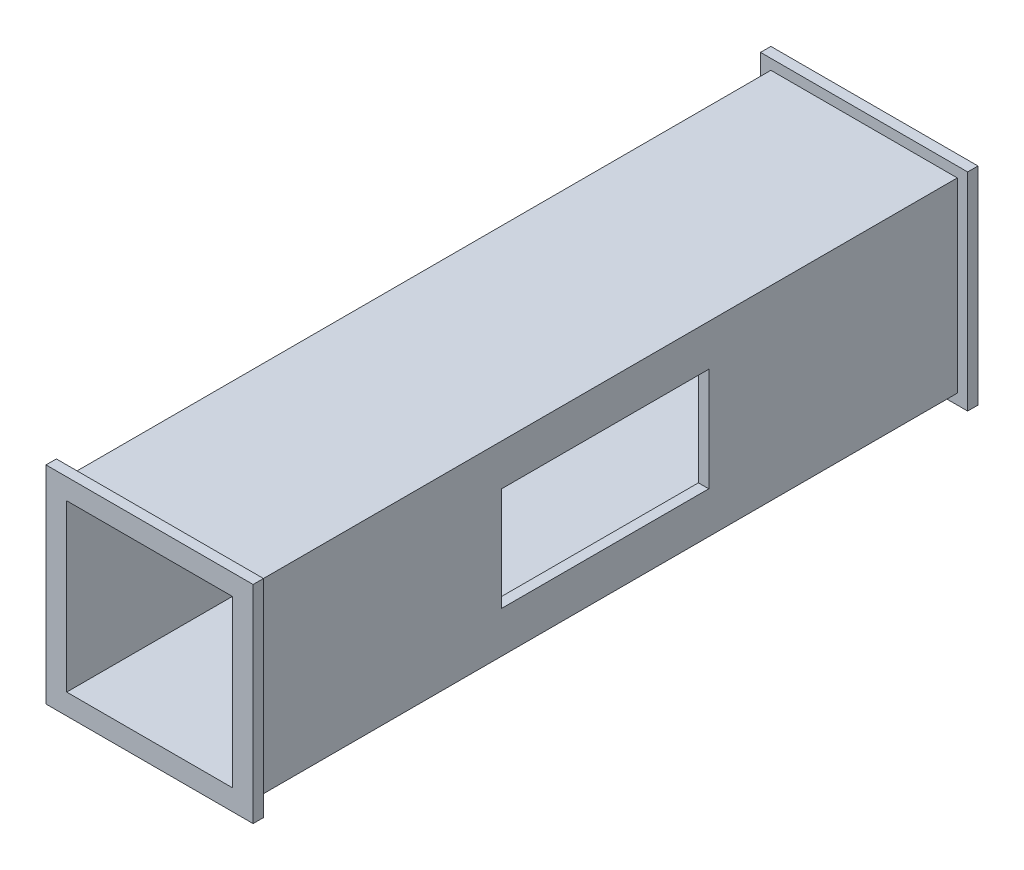
ISO-10303-21;
HEADER;
FILE_DESCRIPTION(('STEP AP214'),'2;1');
FILE_NAME('part.step','',(''),(''),'','','');
FILE_SCHEMA(('AUTOMOTIVE_DESIGN { 1 0 10303 214 1 1 1 1 }'));
ENDSEC;
DATA;
#1=APPLICATION_CONTEXT('core data for automotive mechanical design processes');
#2=APPLICATION_PROTOCOL_DEFINITION('international standard','automotive_design',2000,#1);
#3=PRODUCT_CONTEXT('',#1,'mechanical');
#4=PRODUCT('Part','Part','',(#3));
#5=PRODUCT_RELATED_PRODUCT_CATEGORY('part','',(#4));
#6=PRODUCT_DEFINITION_FORMATION('','',#4);
#7=PRODUCT_DEFINITION_CONTEXT('part definition',#1,'design');
#8=PRODUCT_DEFINITION('design','',#6,#7);
#9=PRODUCT_DEFINITION_SHAPE('','',#8);
#10=(LENGTH_UNIT() NAMED_UNIT(*) SI_UNIT(.MILLI.,.METRE.));
#11=(NAMED_UNIT(*) PLANE_ANGLE_UNIT() SI_UNIT($,.RADIAN.));
#12=(NAMED_UNIT(*) SI_UNIT($,.STERADIAN.) SOLID_ANGLE_UNIT());
#13=UNCERTAINTY_MEASURE_WITH_UNIT(LENGTH_MEASURE(1.E-05),#10,'distance_accuracy_value','');
#14=(GEOMETRIC_REPRESENTATION_CONTEXT(3) GLOBAL_UNCERTAINTY_ASSIGNED_CONTEXT((#13)) GLOBAL_UNIT_ASSIGNED_CONTEXT((#10,
#11,#12)) REPRESENTATION_CONTEXT('',''));
#15=CARTESIAN_POINT('',(0.,0.,0.));
#16=DIRECTION('',(0.,0.,1.));
#17=DIRECTION('',(1.,0.,0.));
#18=AXIS2_PLACEMENT_3D('',#15,#16,#17);
#19=CARTESIAN_POINT('',(45.,-45.,350.));
#20=DIRECTION('',(-1.,0.,0.));
#21=DIRECTION('',(0.,0.,1.));
#22=AXIS2_PLACEMENT_3D('',#19,#20,#21);
#23=PLANE('',#22);
#24=DIRECTION('',(0.,0.,1.));
#25=VECTOR('',#24,1.);
#26=CARTESIAN_POINT('',(45.,25.,225.));
#27=LINE('',#26,#25);
#28=CARTESIAN_POINT('',(45.,25.,125.));
#29=VERTEX_POINT('',#28);
#30=CARTESIAN_POINT('',(45.,25.,225.));
#31=VERTEX_POINT('',#30);
#32=EDGE_CURVE('E308',#29,#31,#27,.T.);
#33=ORIENTED_EDGE('',*,*,#32,.F.);
#34=DIRECTION('',(0.,1.,0.));
#35=VECTOR('',#34,1.);
#36=CARTESIAN_POINT('',(45.,25.,125.));
#37=LINE('',#36,#35);
#38=CARTESIAN_POINT('',(45.,-25.,125.));
#39=VERTEX_POINT('',#38);
#40=EDGE_CURVE('E297',#39,#29,#37,.T.);
#41=ORIENTED_EDGE('',*,*,#40,.F.);
#42=DIRECTION('',(0.,0.,-1.));
#43=VECTOR('',#42,1.);
#44=CARTESIAN_POINT('',(45.,-25.,225.));
#45=LINE('',#44,#43);
#46=CARTESIAN_POINT('',(45.,-25.,225.));
#47=VERTEX_POINT('',#46);
#48=EDGE_CURVE('E316',#47,#39,#45,.T.);
#49=ORIENTED_EDGE('',*,*,#48,.F.);
#50=DIRECTION('',(0.,-1.,0.));
#51=VECTOR('',#50,1.);
#52=CARTESIAN_POINT('',(45.,25.,225.));
#53=LINE('',#52,#51);
#54=EDGE_CURVE('E312',#31,#47,#53,.T.);
#55=ORIENTED_EDGE('',*,*,#54,.F.);
#56=EDGE_LOOP('',(#33,#41,#49,#55));
#57=FACE_BOUND('',#56,.T.);
#58=DIRECTION('',(0.,-1.,0.));
#59=VECTOR('',#58,1.);
#60=CARTESIAN_POINT('',(45.,45.,5.));
#61=LINE('',#60,#59);
#62=CARTESIAN_POINT('',(45.,45.,5.));
#63=VERTEX_POINT('',#62);
#64=CARTESIAN_POINT('',(45.,-45.,5.));
#65=VERTEX_POINT('',#64);
#66=EDGE_CURVE('E54',#63,#65,#61,.T.);
#67=ORIENTED_EDGE('',*,*,#66,.F.);
#68=DIRECTION('',(0.,0.,-1.));
#69=VECTOR('',#68,1.);
#70=CARTESIAN_POINT('',(45.,45.,350.));
#71=LINE('',#70,#69);
#72=CARTESIAN_POINT('',(45.,45.,345.));
#73=VERTEX_POINT('',#72);
#74=EDGE_CURVE('E380',#73,#63,#71,.T.);
#75=ORIENTED_EDGE('',*,*,#74,.F.);
#76=DIRECTION('',(0.,1.,0.));
#77=VECTOR('',#76,1.);
#78=CARTESIAN_POINT('',(45.,-45.,345.));
#79=LINE('',#78,#77);
#80=CARTESIAN_POINT('',(45.,-45.,345.));
#81=VERTEX_POINT('',#80);
#82=EDGE_CURVE('E250',#81,#73,#79,.T.);
#83=ORIENTED_EDGE('',*,*,#82,.F.);
#84=DIRECTION('',(0.,0.,-1.));
#85=VECTOR('',#84,1.);
#86=CARTESIAN_POINT('',(45.,-45.,350.));
#87=LINE('',#86,#85);
#88=EDGE_CURVE('E188',#81,#65,#87,.T.);
#89=ORIENTED_EDGE('',*,*,#88,.T.);
#90=EDGE_LOOP('',(#67,#75,#83,#89));
#91=FACE_BOUND('',#90,.T.);
#92=ADVANCED_FACE('F39',(#57,#91),#23,.F.);
#93=CARTESIAN_POINT('',(-45.,45.,350.));
#94=DIRECTION('',(0.,-1.,0.));
#95=DIRECTION('',(0.,0.,-1.));
#96=AXIS2_PLACEMENT_3D('',#93,#94,#95);
#97=PLANE('',#96);
#98=DIRECTION('',(1.,0.,0.));
#99=VECTOR('',#98,1.);
#100=CARTESIAN_POINT('',(-45.,45.,5.));
#101=LINE('',#100,#99);
#102=CARTESIAN_POINT('',(-45.,45.,5.));
#103=VERTEX_POINT('',#102);
#104=EDGE_CURVE('E61',#103,#63,#101,.T.);
#105=ORIENTED_EDGE('',*,*,#104,.F.);
#106=DIRECTION('',(0.,0.,-1.));
#107=VECTOR('',#106,1.);
#108=CARTESIAN_POINT('',(-45.,45.,350.));
#109=LINE('',#108,#107);
#110=CARTESIAN_POINT('',(-45.,45.,345.));
#111=VERTEX_POINT('',#110);
#112=EDGE_CURVE('E187',#111,#103,#109,.T.);
#113=ORIENTED_EDGE('',*,*,#112,.F.);
#114=DIRECTION('',(-1.,0.,0.));
#115=VECTOR('',#114,1.);
#116=CARTESIAN_POINT('',(45.,45.,345.));
#117=LINE('',#116,#115);
#118=EDGE_CURVE('E254',#73,#111,#117,.T.);
#119=ORIENTED_EDGE('',*,*,#118,.F.);
#120=ORIENTED_EDGE('',*,*,#74,.T.);
#121=EDGE_LOOP('',(#105,#113,#119,#120));
#122=FACE_BOUND('',#121,.T.);
#123=ADVANCED_FACE('F414',(#122),#97,.F.);
#124=CARTESIAN_POINT('',(-45.,-45.,350.));
#125=DIRECTION('',(1.,0.,0.));
#126=DIRECTION('',(0.,0.,-1.));
#127=AXIS2_PLACEMENT_3D('',#124,#125,#126);
#128=PLANE('',#127);
#129=DIRECTION('',(0.,1.,0.));
#130=VECTOR('',#129,1.);
#131=CARTESIAN_POINT('',(-45.,-45.,5.));
#132=LINE('',#131,#130);
#133=CARTESIAN_POINT('',(-45.,-45.,5.));
#134=VERTEX_POINT('',#133);
#135=EDGE_CURVE('E191',#134,#103,#132,.T.);
#136=ORIENTED_EDGE('',*,*,#135,.F.);
#137=DIRECTION('',(0.,0.,-1.));
#138=VECTOR('',#137,1.);
#139=CARTESIAN_POINT('',(-45.,-45.,350.));
#140=LINE('',#139,#138);
#141=CARTESIAN_POINT('',(-45.,-45.,345.));
#142=VERTEX_POINT('',#141);
#143=EDGE_CURVE('E177',#142,#134,#140,.T.);
#144=ORIENTED_EDGE('',*,*,#143,.F.);
#145=DIRECTION('',(0.,-1.,0.));
#146=VECTOR('',#145,1.);
#147=CARTESIAN_POINT('',(-45.,45.,345.));
#148=LINE('',#147,#146);
#149=EDGE_CURVE('E258',#111,#142,#148,.T.);
#150=ORIENTED_EDGE('',*,*,#149,.F.);
#151=ORIENTED_EDGE('',*,*,#112,.T.);
#152=EDGE_LOOP('',(#136,#144,#150,#151));
#153=FACE_BOUND('',#152,.T.);
#154=ADVANCED_FACE('F192',(#153),#128,.F.);
#155=CARTESIAN_POINT('',(-45.,-45.,350.));
#156=DIRECTION('',(0.,1.,0.));
#157=DIRECTION('',(0.,0.,1.));
#158=AXIS2_PLACEMENT_3D('',#155,#156,#157);
#159=PLANE('',#158);
#160=DIRECTION('',(-1.,0.,0.));
#161=VECTOR('',#160,1.);
#162=CARTESIAN_POINT('',(45.,-45.,5.));
#163=LINE('',#162,#161);
#164=EDGE_CURVE('E181',#65,#134,#163,.T.);
#165=ORIENTED_EDGE('',*,*,#164,.F.);
#166=ORIENTED_EDGE('',*,*,#88,.F.);
#167=DIRECTION('',(1.,0.,0.));
#168=VECTOR('',#167,1.);
#169=CARTESIAN_POINT('',(-45.,-45.,345.));
#170=LINE('',#169,#168);
#171=EDGE_CURVE('E183',#142,#81,#170,.T.);
#172=ORIENTED_EDGE('',*,*,#171,.F.);
#173=ORIENTED_EDGE('',*,*,#143,.T.);
#174=EDGE_LOOP('',(#165,#166,#172,#173));
#175=FACE_BOUND('',#174,.T.);
#176=ADVANCED_FACE('F179',(#175),#159,.F.);
#177=CARTESIAN_POINT('',(0.,0.,350.));
#178=DIRECTION('',(0.,0.,-1.));
#179=DIRECTION('',(-1.,0.,0.));
#180=AXIS2_PLACEMENT_3D('',#177,#178,#179);
#181=PLANE('',#180);
#182=DIRECTION('',(0.,1.,0.));
#183=VECTOR('',#182,1.);
#184=CARTESIAN_POINT('',(40.,0.,350.));
#185=LINE('',#184,#183);
#186=CARTESIAN_POINT('',(40.,-40.,350.));
#187=VERTEX_POINT('',#186);
#188=CARTESIAN_POINT('',(40.,40.,350.));
#189=VERTEX_POINT('',#188);
#190=EDGE_CURVE('E357',#187,#189,#185,.T.);
#191=ORIENTED_EDGE('',*,*,#190,.F.);
#192=DIRECTION('',(1.,0.,0.));
#193=VECTOR('',#192,1.);
#194=CARTESIAN_POINT('',(0.,-40.,350.));
#195=LINE('',#194,#193);
#196=CARTESIAN_POINT('',(-40.,-40.,350.));
#197=VERTEX_POINT('',#196);
#198=EDGE_CURVE('E343',#197,#187,#195,.T.);
#199=ORIENTED_EDGE('',*,*,#198,.F.);
#200=DIRECTION('',(0.,-1.,0.));
#201=VECTOR('',#200,1.);
#202=CARTESIAN_POINT('',(-40.,0.,350.));
#203=LINE('',#202,#201);
#204=CARTESIAN_POINT('',(-40.,40.,350.));
#205=VERTEX_POINT('',#204);
#206=EDGE_CURVE('E370',#205,#197,#203,.T.);
#207=ORIENTED_EDGE('',*,*,#206,.F.);
#208=DIRECTION('',(-1.,0.,0.));
#209=VECTOR('',#208,1.);
#210=CARTESIAN_POINT('',(0.,40.,350.));
#211=LINE('',#210,#209);
#212=EDGE_CURVE('E367',#189,#205,#211,.T.);
#213=ORIENTED_EDGE('',*,*,#212,.F.);
#214=EDGE_LOOP('',(#191,#199,#207,#213));
#215=FACE_BOUND('',#214,.T.);
#216=DIRECTION('',(1.,0.,0.));
#217=VECTOR('',#216,1.);
#218=CARTESIAN_POINT('',(-50.,-50.,350.));
#219=LINE('',#218,#217);
#220=CARTESIAN_POINT('',(-50.,-50.,350.));
#221=VERTEX_POINT('',#220);
#222=CARTESIAN_POINT('',(50.,-50.,350.));
#223=VERTEX_POINT('',#222);
#224=EDGE_CURVE('E261',#221,#223,#219,.T.);
#225=ORIENTED_EDGE('',*,*,#224,.T.);
#226=DIRECTION('',(0.,1.,0.));
#227=VECTOR('',#226,1.);
#228=CARTESIAN_POINT('',(50.,-50.,350.));
#229=LINE('',#228,#227);
#230=CARTESIAN_POINT('',(50.,50.,350.));
#231=VERTEX_POINT('',#230);
#232=EDGE_CURVE('E283',#223,#231,#229,.T.);
#233=ORIENTED_EDGE('',*,*,#232,.T.);
#234=DIRECTION('',(-1.,0.,0.));
#235=VECTOR('',#234,1.);
#236=CARTESIAN_POINT('',(50.,50.,350.));
#237=LINE('',#236,#235);
#238=CARTESIAN_POINT('',(-50.,50.,350.));
#239=VERTEX_POINT('',#238);
#240=EDGE_CURVE('E287',#231,#239,#237,.T.);
#241=ORIENTED_EDGE('',*,*,#240,.T.);
#242=DIRECTION('',(0.,-1.,0.));
#243=VECTOR('',#242,1.);
#244=CARTESIAN_POINT('',(-50.,50.,350.));
#245=LINE('',#244,#243);
#246=EDGE_CURVE('E267',#239,#221,#245,.T.);
#247=ORIENTED_EDGE('',*,*,#246,.T.);
#248=EDGE_LOOP('',(#225,#233,#241,#247));
#249=FACE_BOUND('',#248,.T.);
#250=ADVANCED_FACE('F425',(#215,#249),#181,.F.);
#251=CARTESIAN_POINT('',(0.,0.,0.));
#252=DIRECTION('',(0.,0.,-1.));
#253=DIRECTION('',(-1.,0.,0.));
#254=AXIS2_PLACEMENT_3D('',#251,#252,#253);
#255=PLANE('',#254);
#256=DIRECTION('',(1.,0.,0.));
#257=VECTOR('',#256,1.);
#258=CARTESIAN_POINT('',(0.,-40.,0.));
#259=LINE('',#258,#257);
#260=CARTESIAN_POINT('',(-40.,-40.,0.));
#261=VERTEX_POINT('',#260);
#262=CARTESIAN_POINT('',(40.,-40.,0.));
#263=VERTEX_POINT('',#262);
#264=EDGE_CURVE('E353',#261,#263,#259,.T.);
#265=ORIENTED_EDGE('',*,*,#264,.T.);
#266=DIRECTION('',(0.,1.,0.));
#267=VECTOR('',#266,1.);
#268=CARTESIAN_POINT('',(40.,0.,0.));
#269=LINE('',#268,#267);
#270=CARTESIAN_POINT('',(40.,40.,0.));
#271=VERTEX_POINT('',#270);
#272=EDGE_CURVE('E324',#263,#271,#269,.T.);
#273=ORIENTED_EDGE('',*,*,#272,.T.);
#274=DIRECTION('',(-1.,0.,0.));
#275=VECTOR('',#274,1.);
#276=CARTESIAN_POINT('',(0.,40.,0.));
#277=LINE('',#276,#275);
#278=CARTESIAN_POINT('',(-40.,40.,0.));
#279=VERTEX_POINT('',#278);
#280=EDGE_CURVE('E352',#271,#279,#277,.T.);
#281=ORIENTED_EDGE('',*,*,#280,.T.);
#282=DIRECTION('',(0.,-1.,0.));
#283=VECTOR('',#282,1.);
#284=CARTESIAN_POINT('',(-40.,0.,0.));
#285=LINE('',#284,#283);
#286=EDGE_CURVE('E358',#279,#261,#285,.T.);
#287=ORIENTED_EDGE('',*,*,#286,.T.);
#288=EDGE_LOOP('',(#265,#273,#281,#287));
#289=FACE_BOUND('',#288,.T.);
#290=DIRECTION('',(1.,0.,0.));
#291=VECTOR('',#290,1.);
#292=CARTESIAN_POINT('',(-50.,50.,0.));
#293=LINE('',#292,#291);
#294=CARTESIAN_POINT('',(-50.,50.,0.));
#295=VERTEX_POINT('',#294);
#296=CARTESIAN_POINT('',(50.,50.,0.));
#297=VERTEX_POINT('',#296);
#298=EDGE_CURVE('E195',#295,#297,#293,.T.);
#299=ORIENTED_EDGE('',*,*,#298,.T.);
#300=DIRECTION('',(0.,-1.,0.));
#301=VECTOR('',#300,1.);
#302=CARTESIAN_POINT('',(50.,50.,0.));
#303=LINE('',#302,#301);
#304=CARTESIAN_POINT('',(50.,-50.,0.));
#305=VERTEX_POINT('',#304);
#306=EDGE_CURVE('E226',#297,#305,#303,.T.);
#307=ORIENTED_EDGE('',*,*,#306,.T.);
#308=DIRECTION('',(-1.,0.,0.));
#309=VECTOR('',#308,1.);
#310=CARTESIAN_POINT('',(50.,-50.,0.));
#311=LINE('',#310,#309);
#312=CARTESIAN_POINT('',(-50.,-50.,0.));
#313=VERTEX_POINT('',#312);
#314=EDGE_CURVE('E230',#305,#313,#311,.T.);
#315=ORIENTED_EDGE('',*,*,#314,.T.);
#316=DIRECTION('',(0.,1.,0.));
#317=VECTOR('',#316,1.);
#318=CARTESIAN_POINT('',(-50.,-50.,0.));
#319=LINE('',#318,#317);
#320=EDGE_CURVE('E210',#313,#295,#319,.T.);
#321=ORIENTED_EDGE('',*,*,#320,.T.);
#322=EDGE_LOOP('',(#299,#307,#315,#321));
#323=FACE_BOUND('',#322,.T.);
#324=ADVANCED_FACE('F426',(#289,#323),#255,.T.);
#325=CARTESIAN_POINT('',(40.,-45.,350.));
#326=DIRECTION('',(-1.,0.,0.));
#327=DIRECTION('',(0.,0.,1.));
#328=AXIS2_PLACEMENT_3D('',#325,#326,#327);
#329=PLANE('',#328);
#330=DIRECTION('',(0.,-1.,0.));
#331=VECTOR('',#330,1.);
#332=CARTESIAN_POINT('',(40.,-45.,125.));
#333=LINE('',#332,#331);
#334=CARTESIAN_POINT('',(40.,25.,125.));
#335=VERTEX_POINT('',#334);
#336=CARTESIAN_POINT('',(40.,-25.,125.));
#337=VERTEX_POINT('',#336);
#338=EDGE_CURVE('E11',#335,#337,#333,.T.);
#339=ORIENTED_EDGE('',*,*,#338,.F.);
#340=DIRECTION('',(0.,0.,-1.));
#341=VECTOR('',#340,1.);
#342=CARTESIAN_POINT('',(40.,25.,350.));
#343=LINE('',#342,#341);
#344=CARTESIAN_POINT('',(40.,25.,225.));
#345=VERTEX_POINT('',#344);
#346=EDGE_CURVE('E383',#345,#335,#343,.T.);
#347=ORIENTED_EDGE('',*,*,#346,.F.);
#348=DIRECTION('',(0.,1.,0.));
#349=VECTOR('',#348,1.);
#350=CARTESIAN_POINT('',(40.,-45.,225.));
#351=LINE('',#350,#349);
#352=CARTESIAN_POINT('',(40.,-25.,225.));
#353=VERTEX_POINT('',#352);
#354=EDGE_CURVE('E386',#353,#345,#351,.T.);
#355=ORIENTED_EDGE('',*,*,#354,.F.);
#356=DIRECTION('',(0.,0.,1.));
#357=VECTOR('',#356,1.);
#358=CARTESIAN_POINT('',(40.,-25.,350.));
#359=LINE('',#358,#357);
#360=EDGE_CURVE('E47',#337,#353,#359,.T.);
#361=ORIENTED_EDGE('',*,*,#360,.F.);
#362=EDGE_LOOP('',(#339,#347,#355,#361));
#363=FACE_BOUND('',#362,.T.);
#364=ORIENTED_EDGE('',*,*,#272,.F.);
#365=DIRECTION('',(0.,0.,-1.));
#366=VECTOR('',#365,1.);
#367=CARTESIAN_POINT('',(40.,-40.,350.));
#368=LINE('',#367,#366);
#369=EDGE_CURVE('E339',#187,#263,#368,.T.);
#370=ORIENTED_EDGE('',*,*,#369,.F.);
#371=ORIENTED_EDGE('',*,*,#190,.T.);
#372=DIRECTION('',(0.,0.,-1.));
#373=VECTOR('',#372,1.);
#374=CARTESIAN_POINT('',(40.,40.,350.));
#375=LINE('',#374,#373);
#376=EDGE_CURVE('E334',#189,#271,#375,.T.);
#377=ORIENTED_EDGE('',*,*,#376,.T.);
#378=EDGE_LOOP('',(#364,#370,#371,#377));
#379=FACE_BOUND('',#378,.T.);
#380=ADVANCED_FACE('F403',(#363,#379),#329,.T.);
#381=CARTESIAN_POINT('',(-45.,40.,350.));
#382=DIRECTION('',(0.,-1.,0.));
#383=DIRECTION('',(0.,0.,-1.));
#384=AXIS2_PLACEMENT_3D('',#381,#382,#383);
#385=PLANE('',#384);
#386=ORIENTED_EDGE('',*,*,#280,.F.);
#387=ORIENTED_EDGE('',*,*,#376,.F.);
#388=ORIENTED_EDGE('',*,*,#212,.T.);
#389=DIRECTION('',(0.,0.,-1.));
#390=VECTOR('',#389,1.);
#391=CARTESIAN_POINT('',(-40.,40.,350.));
#392=LINE('',#391,#390);
#393=EDGE_CURVE('E338',#205,#279,#392,.T.);
#394=ORIENTED_EDGE('',*,*,#393,.T.);
#395=EDGE_LOOP('',(#386,#387,#388,#394));
#396=FACE_BOUND('',#395,.T.);
#397=ADVANCED_FACE('F440',(#396),#385,.T.);
#398=CARTESIAN_POINT('',(-40.,-45.,350.));
#399=DIRECTION('',(1.,0.,0.));
#400=DIRECTION('',(0.,0.,-1.));
#401=AXIS2_PLACEMENT_3D('',#398,#399,#400);
#402=PLANE('',#401);
#403=ORIENTED_EDGE('',*,*,#286,.F.);
#404=ORIENTED_EDGE('',*,*,#393,.F.);
#405=ORIENTED_EDGE('',*,*,#206,.T.);
#406=DIRECTION('',(0.,0.,-1.));
#407=VECTOR('',#406,1.);
#408=CARTESIAN_POINT('',(-40.,-40.,350.));
#409=LINE('',#408,#407);
#410=EDGE_CURVE('E342',#197,#261,#409,.T.);
#411=ORIENTED_EDGE('',*,*,#410,.T.);
#412=EDGE_LOOP('',(#403,#404,#405,#411));
#413=FACE_BOUND('',#412,.T.);
#414=ADVANCED_FACE('F436',(#413),#402,.T.);
#415=CARTESIAN_POINT('',(-45.,-40.,350.));
#416=DIRECTION('',(0.,1.,0.));
#417=DIRECTION('',(0.,0.,1.));
#418=AXIS2_PLACEMENT_3D('',#415,#416,#417);
#419=PLANE('',#418);
#420=ORIENTED_EDGE('',*,*,#264,.F.);
#421=ORIENTED_EDGE('',*,*,#410,.F.);
#422=ORIENTED_EDGE('',*,*,#198,.T.);
#423=ORIENTED_EDGE('',*,*,#369,.T.);
#424=EDGE_LOOP('',(#420,#421,#422,#423));
#425=FACE_BOUND('',#424,.T.);
#426=ADVANCED_FACE('F433',(#425),#419,.T.);
#427=CARTESIAN_POINT('',(25.,25.,125.));
#428=DIRECTION('',(0.,0.,-1.));
#429=DIRECTION('',(-1.,0.,0.));
#430=AXIS2_PLACEMENT_3D('',#427,#428,#429);
#431=PLANE('',#430);
#432=ORIENTED_EDGE('',*,*,#338,.T.);
#433=DIRECTION('',(1.,0.,0.));
#434=VECTOR('',#433,1.);
#435=CARTESIAN_POINT('',(25.,-25.,125.));
#436=LINE('',#435,#434);
#437=EDGE_CURVE('E321',#337,#39,#436,.T.);
#438=ORIENTED_EDGE('',*,*,#437,.T.);
#439=ORIENTED_EDGE('',*,*,#40,.T.);
#440=DIRECTION('',(1.,0.,0.));
#441=VECTOR('',#440,1.);
#442=CARTESIAN_POINT('',(25.,25.,125.));
#443=LINE('',#442,#441);
#444=EDGE_CURVE('E320',#335,#29,#443,.T.);
#445=ORIENTED_EDGE('',*,*,#444,.F.);
#446=EDGE_LOOP('',(#432,#438,#439,#445));
#447=FACE_BOUND('',#446,.T.);
#448=ADVANCED_FACE('F410',(#447),#431,.F.);
#449=CARTESIAN_POINT('',(25.,-25.,225.));
#450=DIRECTION('',(0.,-1.,0.));
#451=DIRECTION('',(0.,0.,-1.));
#452=AXIS2_PLACEMENT_3D('',#449,#450,#451);
#453=PLANE('',#452);
#454=ORIENTED_EDGE('',*,*,#360,.T.);
#455=DIRECTION('',(1.,0.,0.));
#456=VECTOR('',#455,1.);
#457=CARTESIAN_POINT('',(25.,-25.,225.));
#458=LINE('',#457,#456);
#459=EDGE_CURVE('E325',#353,#47,#458,.T.);
#460=ORIENTED_EDGE('',*,*,#459,.T.);
#461=ORIENTED_EDGE('',*,*,#48,.T.);
#462=ORIENTED_EDGE('',*,*,#437,.F.);
#463=EDGE_LOOP('',(#454,#460,#461,#462));
#464=FACE_BOUND('',#463,.T.);
#465=ADVANCED_FACE('F394',(#464),#453,.F.);
#466=CARTESIAN_POINT('',(25.,25.,225.));
#467=DIRECTION('',(0.,0.,1.));
#468=DIRECTION('',(1.,0.,0.));
#469=AXIS2_PLACEMENT_3D('',#466,#467,#468);
#470=PLANE('',#469);
#471=ORIENTED_EDGE('',*,*,#354,.T.);
#472=DIRECTION('',(1.,0.,0.));
#473=VECTOR('',#472,1.);
#474=CARTESIAN_POINT('',(25.,25.,225.));
#475=LINE('',#474,#473);
#476=EDGE_CURVE('E328',#345,#31,#475,.T.);
#477=ORIENTED_EDGE('',*,*,#476,.T.);
#478=ORIENTED_EDGE('',*,*,#54,.T.);
#479=ORIENTED_EDGE('',*,*,#459,.F.);
#480=EDGE_LOOP('',(#471,#477,#478,#479));
#481=FACE_BOUND('',#480,.T.);
#482=ADVANCED_FACE('F399',(#481),#470,.F.);
#483=CARTESIAN_POINT('',(25.,25.,225.));
#484=DIRECTION('',(0.,1.,0.));
#485=DIRECTION('',(0.,0.,1.));
#486=AXIS2_PLACEMENT_3D('',#483,#484,#485);
#487=PLANE('',#486);
#488=ORIENTED_EDGE('',*,*,#346,.T.);
#489=ORIENTED_EDGE('',*,*,#444,.T.);
#490=ORIENTED_EDGE('',*,*,#32,.T.);
#491=ORIENTED_EDGE('',*,*,#476,.F.);
#492=EDGE_LOOP('',(#488,#489,#490,#491));
#493=FACE_BOUND('',#492,.T.);
#494=ADVANCED_FACE('F407',(#493),#487,.F.);
#495=CARTESIAN_POINT('',(-50.,-50.,345.));
#496=DIRECTION('',(0.,-1.,0.));
#497=DIRECTION('',(0.,0.,-1.));
#498=AXIS2_PLACEMENT_3D('',#495,#496,#497);
#499=PLANE('',#498);
#500=ORIENTED_EDGE('',*,*,#224,.F.);
#501=DIRECTION('',(0.,0.,1.));
#502=VECTOR('',#501,1.);
#503=CARTESIAN_POINT('',(-50.,-50.,345.));
#504=LINE('',#503,#502);
#505=CARTESIAN_POINT('',(-50.,-50.,345.));
#506=VERTEX_POINT('',#505);
#507=EDGE_CURVE('E294',#506,#221,#504,.T.);
#508=ORIENTED_EDGE('',*,*,#507,.F.);
#509=DIRECTION('',(1.,0.,0.));
#510=VECTOR('',#509,1.);
#511=CARTESIAN_POINT('',(-50.,-50.,345.));
#512=LINE('',#511,#510);
#513=CARTESIAN_POINT('',(50.,-50.,345.));
#514=VERTEX_POINT('',#513);
#515=EDGE_CURVE('E262',#506,#514,#512,.T.);
#516=ORIENTED_EDGE('',*,*,#515,.T.);
#517=DIRECTION('',(0.,0.,1.));
#518=VECTOR('',#517,1.);
#519=CARTESIAN_POINT('',(50.,-50.,345.));
#520=LINE('',#519,#518);
#521=EDGE_CURVE('E279',#514,#223,#520,.T.);
#522=ORIENTED_EDGE('',*,*,#521,.T.);
#523=EDGE_LOOP('',(#500,#508,#516,#522));
#524=FACE_BOUND('',#523,.T.);
#525=ADVANCED_FACE('F451',(#524),#499,.T.);
#526=CARTESIAN_POINT('',(-50.,50.,345.));
#527=DIRECTION('',(-1.,0.,0.));
#528=DIRECTION('',(0.,0.,1.));
#529=AXIS2_PLACEMENT_3D('',#526,#527,#528);
#530=PLANE('',#529);
#531=ORIENTED_EDGE('',*,*,#246,.F.);
#532=DIRECTION('',(0.,0.,1.));
#533=VECTOR('',#532,1.);
#534=CARTESIAN_POINT('',(-50.,50.,345.));
#535=LINE('',#534,#533);
#536=CARTESIAN_POINT('',(-50.,50.,345.));
#537=VERTEX_POINT('',#536);
#538=EDGE_CURVE('E298',#537,#239,#535,.T.);
#539=ORIENTED_EDGE('',*,*,#538,.F.);
#540=DIRECTION('',(0.,-1.,0.));
#541=VECTOR('',#540,1.);
#542=CARTESIAN_POINT('',(-50.,50.,345.));
#543=LINE('',#542,#541);
#544=EDGE_CURVE('E275',#537,#506,#543,.T.);
#545=ORIENTED_EDGE('',*,*,#544,.T.);
#546=ORIENTED_EDGE('',*,*,#507,.T.);
#547=EDGE_LOOP('',(#531,#539,#545,#546));
#548=FACE_BOUND('',#547,.T.);
#549=ADVANCED_FACE('F458',(#548),#530,.T.);
#550=CARTESIAN_POINT('',(50.,50.,345.));
#551=DIRECTION('',(0.,1.,0.));
#552=DIRECTION('',(0.,0.,1.));
#553=AXIS2_PLACEMENT_3D('',#550,#551,#552);
#554=PLANE('',#553);
#555=ORIENTED_EDGE('',*,*,#240,.F.);
#556=DIRECTION('',(0.,0.,1.));
#557=VECTOR('',#556,1.);
#558=CARTESIAN_POINT('',(50.,50.,345.));
#559=LINE('',#558,#557);
#560=CARTESIAN_POINT('',(50.,50.,345.));
#561=VERTEX_POINT('',#560);
#562=EDGE_CURVE('E301',#561,#231,#559,.T.);
#563=ORIENTED_EDGE('',*,*,#562,.F.);
#564=DIRECTION('',(-1.,0.,0.));
#565=VECTOR('',#564,1.);
#566=CARTESIAN_POINT('',(50.,50.,345.));
#567=LINE('',#566,#565);
#568=EDGE_CURVE('E271',#561,#537,#567,.T.);
#569=ORIENTED_EDGE('',*,*,#568,.T.);
#570=ORIENTED_EDGE('',*,*,#538,.T.);
#571=EDGE_LOOP('',(#555,#563,#569,#570));
#572=FACE_BOUND('',#571,.T.);
#573=ADVANCED_FACE('F464',(#572),#554,.T.);
#574=CARTESIAN_POINT('',(50.,-50.,345.));
#575=DIRECTION('',(1.,0.,0.));
#576=DIRECTION('',(0.,0.,-1.));
#577=AXIS2_PLACEMENT_3D('',#574,#575,#576);
#578=PLANE('',#577);
#579=ORIENTED_EDGE('',*,*,#232,.F.);
#580=ORIENTED_EDGE('',*,*,#521,.F.);
#581=DIRECTION('',(0.,1.,0.));
#582=VECTOR('',#581,1.);
#583=CARTESIAN_POINT('',(50.,-50.,345.));
#584=LINE('',#583,#582);
#585=EDGE_CURVE('E266',#514,#561,#584,.T.);
#586=ORIENTED_EDGE('',*,*,#585,.T.);
#587=ORIENTED_EDGE('',*,*,#562,.T.);
#588=EDGE_LOOP('',(#579,#580,#586,#587));
#589=FACE_BOUND('',#588,.T.);
#590=ADVANCED_FACE('F460',(#589),#578,.T.);
#591=CARTESIAN_POINT('',(0.,0.,345.));
#592=DIRECTION('',(0.,0.,1.));
#593=DIRECTION('',(1.,0.,0.));
#594=AXIS2_PLACEMENT_3D('',#591,#592,#593);
#595=PLANE('',#594);
#596=ORIENTED_EDGE('',*,*,#149,.T.);
#597=ORIENTED_EDGE('',*,*,#171,.T.);
#598=ORIENTED_EDGE('',*,*,#82,.T.);
#599=ORIENTED_EDGE('',*,*,#118,.T.);
#600=EDGE_LOOP('',(#596,#597,#598,#599));
#601=FACE_BOUND('',#600,.T.);
#602=ORIENTED_EDGE('',*,*,#515,.F.);
#603=ORIENTED_EDGE('',*,*,#544,.F.);
#604=ORIENTED_EDGE('',*,*,#568,.F.);
#605=ORIENTED_EDGE('',*,*,#585,.F.);
#606=EDGE_LOOP('',(#602,#603,#604,#605));
#607=FACE_BOUND('',#606,.T.);
#608=ADVANCED_FACE('F463',(#601,#607),#595,.F.);
#609=CARTESIAN_POINT('',(-50.,50.,5.));
#610=DIRECTION('',(0.,1.,0.));
#611=DIRECTION('',(0.,0.,1.));
#612=AXIS2_PLACEMENT_3D('',#609,#610,#611);
#613=PLANE('',#612);
#614=ORIENTED_EDGE('',*,*,#298,.F.);
#615=DIRECTION('',(0.,0.,-1.));
#616=VECTOR('',#615,1.);
#617=CARTESIAN_POINT('',(-50.,50.,5.));
#618=LINE('',#617,#616);
#619=CARTESIAN_POINT('',(-50.,50.,5.));
#620=VERTEX_POINT('',#619);
#621=EDGE_CURVE('E237',#620,#295,#618,.T.);
#622=ORIENTED_EDGE('',*,*,#621,.F.);
#623=DIRECTION('',(1.,0.,0.));
#624=VECTOR('',#623,1.);
#625=CARTESIAN_POINT('',(-50.,50.,5.));
#626=LINE('',#625,#624);
#627=CARTESIAN_POINT('',(50.,50.,5.));
#628=VERTEX_POINT('',#627);
#629=EDGE_CURVE('E205',#620,#628,#626,.T.);
#630=ORIENTED_EDGE('',*,*,#629,.T.);
#631=DIRECTION('',(0.,0.,-1.));
#632=VECTOR('',#631,1.);
#633=CARTESIAN_POINT('',(50.,50.,5.));
#634=LINE('',#633,#632);
#635=EDGE_CURVE('E222',#628,#297,#634,.T.);
#636=ORIENTED_EDGE('',*,*,#635,.T.);
#637=EDGE_LOOP('',(#614,#622,#630,#636));
#638=FACE_BOUND('',#637,.T.);
#639=ADVANCED_FACE('F474',(#638),#613,.T.);
#640=CARTESIAN_POINT('',(-50.,-50.,5.));
#641=DIRECTION('',(-1.,0.,0.));
#642=DIRECTION('',(0.,0.,1.));
#643=AXIS2_PLACEMENT_3D('',#640,#641,#642);
#644=PLANE('',#643);
#645=ORIENTED_EDGE('',*,*,#320,.F.);
#646=DIRECTION('',(0.,0.,-1.));
#647=VECTOR('',#646,1.);
#648=CARTESIAN_POINT('',(-50.,-50.,5.));
#649=LINE('',#648,#647);
#650=CARTESIAN_POINT('',(-50.,-50.,5.));
#651=VERTEX_POINT('',#650);
#652=EDGE_CURVE('E240',#651,#313,#649,.T.);
#653=ORIENTED_EDGE('',*,*,#652,.F.);
#654=DIRECTION('',(0.,1.,0.));
#655=VECTOR('',#654,1.);
#656=CARTESIAN_POINT('',(-50.,-50.,5.));
#657=LINE('',#656,#655);
#658=EDGE_CURVE('E218',#651,#620,#657,.T.);
#659=ORIENTED_EDGE('',*,*,#658,.T.);
#660=ORIENTED_EDGE('',*,*,#621,.T.);
#661=EDGE_LOOP('',(#645,#653,#659,#660));
#662=FACE_BOUND('',#661,.T.);
#663=ADVANCED_FACE('F478',(#662),#644,.T.);
#664=CARTESIAN_POINT('',(50.,-50.,5.));
#665=DIRECTION('',(0.,-1.,0.));
#666=DIRECTION('',(0.,0.,-1.));
#667=AXIS2_PLACEMENT_3D('',#664,#665,#666);
#668=PLANE('',#667);
#669=ORIENTED_EDGE('',*,*,#314,.F.);
#670=DIRECTION('',(0.,0.,-1.));
#671=VECTOR('',#670,1.);
#672=CARTESIAN_POINT('',(50.,-50.,5.));
#673=LINE('',#672,#671);
#674=CARTESIAN_POINT('',(50.,-50.,5.));
#675=VERTEX_POINT('',#674);
#676=EDGE_CURVE('E243',#675,#305,#673,.T.);
#677=ORIENTED_EDGE('',*,*,#676,.F.);
#678=DIRECTION('',(-1.,0.,0.));
#679=VECTOR('',#678,1.);
#680=CARTESIAN_POINT('',(50.,-50.,5.));
#681=LINE('',#680,#679);
#682=EDGE_CURVE('E214',#675,#651,#681,.T.);
#683=ORIENTED_EDGE('',*,*,#682,.T.);
#684=ORIENTED_EDGE('',*,*,#652,.T.);
#685=EDGE_LOOP('',(#669,#677,#683,#684));
#686=FACE_BOUND('',#685,.T.);
#687=ADVANCED_FACE('F483',(#686),#668,.T.);
#688=CARTESIAN_POINT('',(50.,50.,5.));
#689=DIRECTION('',(1.,0.,0.));
#690=DIRECTION('',(0.,0.,-1.));
#691=AXIS2_PLACEMENT_3D('',#688,#689,#690);
#692=PLANE('',#691);
#693=ORIENTED_EDGE('',*,*,#306,.F.);
#694=ORIENTED_EDGE('',*,*,#635,.F.);
#695=DIRECTION('',(0.,-1.,0.));
#696=VECTOR('',#695,1.);
#697=CARTESIAN_POINT('',(50.,50.,5.));
#698=LINE('',#697,#696);
#699=EDGE_CURVE('E209',#628,#675,#698,.T.);
#700=ORIENTED_EDGE('',*,*,#699,.T.);
#701=ORIENTED_EDGE('',*,*,#676,.T.);
#702=EDGE_LOOP('',(#693,#694,#700,#701));
#703=FACE_BOUND('',#702,.T.);
#704=ADVANCED_FACE('F480',(#703),#692,.T.);
#705=CARTESIAN_POINT('',(0.,0.,5.));
#706=DIRECTION('',(0.,0.,-1.));
#707=DIRECTION('',(-1.,0.,0.));
#708=AXIS2_PLACEMENT_3D('',#705,#706,#707);
#709=PLANE('',#708);
#710=ORIENTED_EDGE('',*,*,#135,.T.);
#711=ORIENTED_EDGE('',*,*,#104,.T.);
#712=ORIENTED_EDGE('',*,*,#66,.T.);
#713=ORIENTED_EDGE('',*,*,#164,.T.);
#714=EDGE_LOOP('',(#710,#711,#712,#713));
#715=FACE_BOUND('',#714,.T.);
#716=ORIENTED_EDGE('',*,*,#629,.F.);
#717=ORIENTED_EDGE('',*,*,#658,.F.);
#718=ORIENTED_EDGE('',*,*,#682,.F.);
#719=ORIENTED_EDGE('',*,*,#699,.F.);
#720=EDGE_LOOP('',(#716,#717,#718,#719));
#721=FACE_BOUND('',#720,.T.);
#722=ADVANCED_FACE('F197',(#715,#721),#709,.F.);
#723=CLOSED_SHELL('',(#92,#123,#154,#176,#250,#324,#380,#397,#414,#426,#448,#465,#482,#494,#525,
#549,#573,#590,#608,#639,#663,#687,#704,#722));
#724=MANIFOLD_SOLID_BREP('B2',#723);
#725=ADVANCED_BREP_SHAPE_REPRESENTATION('',(#18,#724),#14);
#726=SHAPE_DEFINITION_REPRESENTATION(#9,#725);
ENDSEC;
END-ISO-10303-21;
